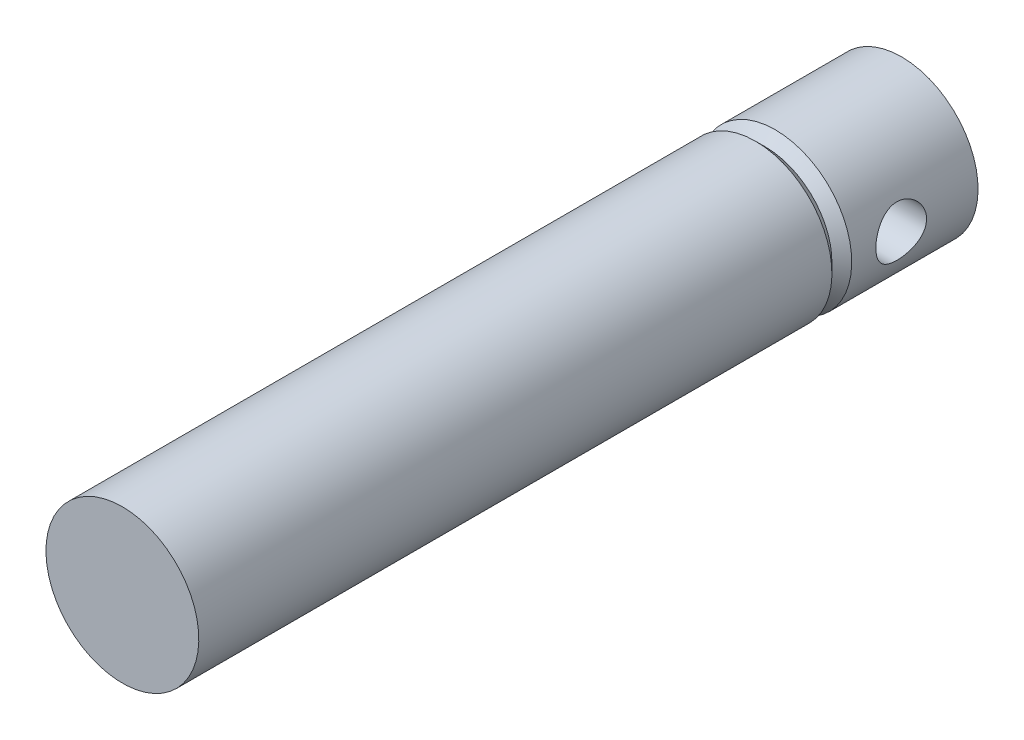
ISO-10303-21;
HEADER;
FILE_DESCRIPTION(('STEP AP214'),'2;1');
FILE_NAME('part.step','',(''),(''),'','','');
FILE_SCHEMA(('AUTOMOTIVE_DESIGN { 1 0 10303 214 1 1 1 1 }'));
ENDSEC;
DATA;
#1=APPLICATION_CONTEXT('core data for automotive mechanical design processes');
#2=APPLICATION_PROTOCOL_DEFINITION('international standard','automotive_design',2000,#1);
#3=PRODUCT_CONTEXT('',#1,'mechanical');
#4=PRODUCT('Part','Part','',(#3));
#5=PRODUCT_RELATED_PRODUCT_CATEGORY('part','',(#4));
#6=PRODUCT_DEFINITION_FORMATION('','',#4);
#7=PRODUCT_DEFINITION_CONTEXT('part definition',#1,'design');
#8=PRODUCT_DEFINITION('design','',#6,#7);
#9=PRODUCT_DEFINITION_SHAPE('','',#8);
#10=(LENGTH_UNIT() NAMED_UNIT(*) SI_UNIT(.MILLI.,.METRE.));
#11=(NAMED_UNIT(*) PLANE_ANGLE_UNIT() SI_UNIT($,.RADIAN.));
#12=(NAMED_UNIT(*) SI_UNIT($,.STERADIAN.) SOLID_ANGLE_UNIT());
#13=UNCERTAINTY_MEASURE_WITH_UNIT(LENGTH_MEASURE(1.E-05),#10,'distance_accuracy_value','');
#14=(GEOMETRIC_REPRESENTATION_CONTEXT(3) GLOBAL_UNCERTAINTY_ASSIGNED_CONTEXT((#13)) GLOBAL_UNIT_ASSIGNED_CONTEXT((#10,
#11,#12)) REPRESENTATION_CONTEXT('',''));
#15=CARTESIAN_POINT('',(0.,0.,0.));
#16=DIRECTION('',(0.,0.,1.));
#17=DIRECTION('',(1.,0.,0.));
#18=AXIS2_PLACEMENT_3D('',#15,#16,#17);
#19=CARTESIAN_POINT('',(0.,0.,-51.45));
#20=DIRECTION('',(0.,0.,-1.));
#21=DIRECTION('',(0.,1.,0.));
#22=AXIS2_PLACEMENT_3D('',#19,#20,#21);
#23=CONICAL_SURFACE('',#22,9.65000000000002,0.785398163397447);
#24=CARTESIAN_POINT('',(0.,0.,-50.2));
#25=DIRECTION('',(0.,0.,-1.));
#26=DIRECTION('',(0.,1.,0.));
#27=AXIS2_PLACEMENT_3D('',#24,#25,#26);
#28=CIRCLE('',#27,8.40000000000002);
#29=CARTESIAN_POINT('',(0.,8.40000000000001,-50.2));
#30=VERTEX_POINT('',#29);
#31=EDGE_CURVE('E52',#30,#30,#28,.T.);
#32=ORIENTED_EDGE('',*,*,#31,.T.);
#33=EDGE_LOOP('',(#32));
#34=FACE_BOUND('',#33,.T.);
#35=CARTESIAN_POINT('',(0.,0.,-51.45));
#36=DIRECTION('',(0.,0.,-1.));
#37=DIRECTION('',(0.,1.,0.));
#38=AXIS2_PLACEMENT_3D('',#35,#36,#37);
#39=CIRCLE('',#38,9.65000000000002);
#40=CARTESIAN_POINT('',(0.,9.65000000000001,-51.45));
#41=VERTEX_POINT('',#40);
#42=EDGE_CURVE('E48',#41,#41,#39,.T.);
#43=ORIENTED_EDGE('',*,*,#42,.F.);
#44=EDGE_LOOP('',(#43));
#45=FACE_BOUND('',#44,.T.);
#46=ADVANCED_FACE('F34',(#34,#45),#23,.T.);
#47=CARTESIAN_POINT('',(0.,0.,-50.2));
#48=DIRECTION('',(0.,0.,1.));
#49=DIRECTION('',(0.,-1.,0.));
#50=AXIS2_PLACEMENT_3D('',#47,#48,#49);
#51=CONICAL_SURFACE('',#50,8.40000000000002,0.785398163397447);
#52=CARTESIAN_POINT('',(0.,0.,-48.95));
#53=DIRECTION('',(0.,0.,-1.));
#54=DIRECTION('',(0.,1.,0.));
#55=AXIS2_PLACEMENT_3D('',#52,#53,#54);
#56=CIRCLE('',#55,9.65000000000002);
#57=CARTESIAN_POINT('',(0.,9.65000000000001,-48.95));
#58=VERTEX_POINT('',#57);
#59=EDGE_CURVE('E90',#58,#58,#56,.T.);
#60=ORIENTED_EDGE('',*,*,#59,.T.);
#61=EDGE_LOOP('',(#60));
#62=FACE_BOUND('',#61,.T.);
#63=ORIENTED_EDGE('',*,*,#31,.F.);
#64=EDGE_LOOP('',(#63));
#65=FACE_BOUND('',#64,.T.);
#66=ADVANCED_FACE('F70',(#62,#65),#51,.T.);
#67=CARTESIAN_POINT('',(0.,0.,-67.4));
#68=DIRECTION('',(0.,0.,-1.));
#69=DIRECTION('',(0.,1.,0.));
#70=AXIS2_PLACEMENT_3D('',#67,#68,#69);
#71=CYLINDRICAL_SURFACE('',#70,9.65);
#72=CARTESIAN_POINT('',(0.,0.,31.));
#73=DIRECTION('',(0.,0.,-1.));
#74=DIRECTION('',(0.,1.,0.));
#75=AXIS2_PLACEMENT_3D('',#72,#73,#74);
#76=CIRCLE('',#75,9.64999999999998);
#77=CARTESIAN_POINT('',(0.,9.64999999999997,31.));
#78=VERTEX_POINT('',#77);
#79=EDGE_CURVE('E87',#78,#78,#76,.T.);
#80=ORIENTED_EDGE('',*,*,#79,.T.);
#81=EDGE_LOOP('',(#80));
#82=FACE_BOUND('',#81,.T.);
#83=ORIENTED_EDGE('',*,*,#59,.F.);
#84=EDGE_LOOP('',(#83));
#85=FACE_BOUND('',#84,.T.);
#86=ADVANCED_FACE('F75',(#82,#85),#71,.T.);
#87=CARTESIAN_POINT('',(0.,9.64999999999997,31.));
#88=DIRECTION('',(0.,0.,1.));
#89=DIRECTION('',(0.,-1.,0.));
#90=AXIS2_PLACEMENT_3D('',#87,#88,#89);
#91=PLANE('',#90);
#92=ORIENTED_EDGE('',*,*,#79,.F.);
#93=EDGE_LOOP('',(#92));
#94=FACE_BOUND('',#93,.T.);
#95=ADVANCED_FACE('F98',(#94),#91,.T.);
#96=CARTESIAN_POINT('',(0.,9.64999999999998,-67.4));
#97=DIRECTION('',(0.,0.,-1.));
#98=DIRECTION('',(0.,1.,0.));
#99=AXIS2_PLACEMENT_3D('',#96,#97,#98);
#100=PLANE('',#99);
#101=CARTESIAN_POINT('',(0.,0.,-67.4));
#102=DIRECTION('',(0.,0.,-1.));
#103=DIRECTION('',(0.,1.,0.));
#104=AXIS2_PLACEMENT_3D('',#101,#102,#103);
#105=CIRCLE('',#104,9.64999999999999);
#106=CARTESIAN_POINT('',(0.,9.64999999999998,-67.4));
#107=VERTEX_POINT('',#106);
#108=EDGE_CURVE('E85',#107,#107,#105,.T.);
#109=ORIENTED_EDGE('',*,*,#108,.T.);
#110=EDGE_LOOP('',(#109));
#111=FACE_BOUND('',#110,.T.);
#112=ADVANCED_FACE('F67',(#111),#100,.T.);
#113=CARTESIAN_POINT('',(0.,0.,-67.4));
#114=DIRECTION('',(0.,0.,-1.));
#115=DIRECTION('',(0.,1.,0.));
#116=AXIS2_PLACEMENT_3D('',#113,#114,#115);
#117=CYLINDRICAL_SURFACE('',#116,9.64999999999998);
#118=CARTESIAN_POINT('',(-9.64999999999998,0.,-60.9));
#119=CARTESIAN_POINT('',(-9.65000036079675,-0.174653897789779,-60.9000006334956));
#120=CARTESIAN_POINT('',(-9.64521464054339,-0.349304342390432,-60.8856546923451));
#121=CARTESIAN_POINT('',(-9.6265946693467,-0.693464054860672,-60.8288234390391));
#122=CARTESIAN_POINT('',(-9.61275938627899,-0.862972733991802,-60.7863349171477));
#123=CARTESIAN_POINT('',(-9.57754428668876,-1.19183745681564,-60.6748328850261));
#124=CARTESIAN_POINT('',(-9.55617700830016,-1.35120985656734,-60.6058634393382));
#125=CARTESIAN_POINT('',(-9.50808103177193,-1.65612540855754,-60.443555522785));
#126=CARTESIAN_POINT('',(-9.48135129348678,-1.80166586975901,-60.350212323131));
#127=CARTESIAN_POINT('',(-9.42431958080697,-2.07978085156581,-60.1384416926786));
#128=CARTESIAN_POINT('',(-9.39393268292546,-2.21181503775299,-60.0193276481487));
#129=CARTESIAN_POINT('',(-9.33348074553266,-2.45444538078468,-59.7608565615041));
#130=CARTESIAN_POINT('',(-9.30341577725891,-2.56503688170942,-59.6214951344755));
#131=CARTESIAN_POINT('',(-9.24607931167777,-2.76471378071107,-59.3216366092404));
#132=CARTESIAN_POINT('',(-9.21891141347255,-2.85309911217317,-59.1606516163155));
#133=CARTESIAN_POINT('',(-9.171735191717,-3.00131097473524,-58.8250557433361));
#134=CARTESIAN_POINT('',(-9.15172470954563,-3.06114611817133,-58.6504489908828));
#135=CARTESIAN_POINT('',(-9.12202272136045,-3.14853630648973,-58.2987063711595));
#136=CARTESIAN_POINT('',(-9.11200881730373,-3.17710296835677,-58.1218498667209));
#137=CARTESIAN_POINT('',(-9.10247991891681,-3.20430753920392,-57.7655923829035));
#138=CARTESIAN_POINT('',(-9.10296171995759,-3.20295458346877,-57.5861921968995));
#139=CARTESIAN_POINT('',(-9.11408708981729,-3.17114427400848,-57.2385453609995));
#140=CARTESIAN_POINT('',(-9.12427072327504,-3.14200416969871,-57.0701609141696));
#141=CARTESIAN_POINT('',(-9.15290018262581,-3.05759450633912,-56.7408216981468));
#142=CARTESIAN_POINT('',(-9.1713469881602,-3.00232184909824,-56.5798678123816));
#143=CARTESIAN_POINT('',(-9.21475411841719,-2.86634805511928,-56.2669535501883));
#144=CARTESIAN_POINT('',(-9.23981382781117,-2.78525464890579,-56.1151780132885));
#145=CARTESIAN_POINT('',(-9.29358120329426,-2.60021363266278,-55.8269712961445));
#146=CARTESIAN_POINT('',(-9.32228991331454,-2.49625947623401,-55.6905445281202));
#147=CARTESIAN_POINT('',(-9.38193303527769,-2.262109756187,-55.4295022854871));
#148=CARTESIAN_POINT('',(-9.41290583034877,-2.13083640674488,-55.3058603752238));
#149=CARTESIAN_POINT('',(-9.47228964618993,-1.84903693403177,-55.0820933169678));
#150=CARTESIAN_POINT('',(-9.50070042617006,-1.69850900433555,-54.9819703779799));
#151=CARTESIAN_POINT('',(-9.55212535276175,-1.38042450575307,-54.8073103065197));
#152=CARTESIAN_POINT('',(-9.5750843054119,-1.21271651100139,-54.7330315796774));
#153=CARTESIAN_POINT('',(-9.61261823700097,-0.866242649313708,-54.6140411261345));
#154=CARTESIAN_POINT('',(-9.62719609667705,-0.687480605286535,-54.5693192394082));
#155=CARTESIAN_POINT('',(-9.64584925861248,-0.332216823692549,-54.5124310872512));
#156=CARTESIAN_POINT('',(-9.6503487502057,-0.155947763524769,-54.4989490679257));
#157=CARTESIAN_POINT('',(-9.6496089244291,0.196367595282367,-54.5011785707682));
#158=CARTESIAN_POINT('',(-9.64437123173687,0.372413926180367,-54.5168852227211));
#159=CARTESIAN_POINT('',(-9.62502543016232,0.714036631830401,-54.5760037485454));
#160=CARTESIAN_POINT('',(-9.61117539374346,0.879768452568857,-54.6186101113943));
#161=CARTESIAN_POINT('',(-9.57625871437406,1.20166671481131,-54.7293135798545));
#162=CARTESIAN_POINT('',(-9.55519115307115,1.35783193608627,-54.7974139294033));
#163=CARTESIAN_POINT('',(-9.50729522740248,1.6607156763844,-54.9591482708469));
#164=CARTESIAN_POINT('',(-9.48033061296264,1.80708033119676,-55.0534034533914));
#165=CARTESIAN_POINT('',(-9.42369998936823,2.08234469155218,-55.2640407915628));
#166=CARTESIAN_POINT('',(-9.39403316420225,2.2112390920108,-55.3804296427164));
#167=CARTESIAN_POINT('',(-9.33365266728373,2.45393135838051,-55.6382184611753));
#168=CARTESIAN_POINT('',(-9.30295186790586,2.56679043034701,-55.7805073905575));
#169=CARTESIAN_POINT('',(-9.24534070441865,2.76714270135782,-56.0826638962531));
#170=CARTESIAN_POINT('',(-9.21843036290505,2.85463574919296,-56.2425315773471));
#171=CARTESIAN_POINT('',(-9.17171356254244,3.00135317393759,-56.5753386894894));
#172=CARTESIAN_POINT('',(-9.15189147354404,3.06063984477947,-56.7482483288408));
#173=CARTESIAN_POINT('',(-9.12187321225527,3.14899171992454,-57.1024047574582));
#174=CARTESIAN_POINT('',(-9.11167276283215,3.1780703532692,-57.2836478046391));
#175=CARTESIAN_POINT('',(-9.10253569611723,3.20414022270537,-57.6394104130498));
#176=CARTESIAN_POINT('',(-9.10305263043046,3.20268807906263,-57.813803152829));
#177=CARTESIAN_POINT('',(-9.11394303786078,3.17156237273073,-58.1597220674385));
#178=CARTESIAN_POINT('',(-9.12431593583658,3.14189045679635,-58.3312484089421));
#179=CARTESIAN_POINT('',(-9.15334469410703,3.05626442270754,-58.663394433412));
#180=CARTESIAN_POINT('',(-9.1718429108824,3.00080939294464,-58.8241576346992));
#181=CARTESIAN_POINT('',(-9.2149812779449,2.86559463821178,-59.1342214908564));
#182=CARTESIAN_POINT('',(-9.23962278233338,2.78582955396444,-59.283519609094));
#183=CARTESIAN_POINT('',(-9.29360036643081,2.6002315441761,-59.5734152972728));
#184=CARTESIAN_POINT('',(-9.32309342286387,2.49342016708339,-59.7133570455521));
#185=CARTESIAN_POINT('',(-9.38278804451217,2.25842142509402,-59.9738333502889));
#186=CARTESIAN_POINT('',(-9.41298980704126,2.13022804498302,-60.0943624267388));
#187=CARTESIAN_POINT('',(-9.47209176812271,1.85018906137288,-60.3172564907992));
#188=CARTESIAN_POINT('',(-9.50089738339186,1.69762397864177,-60.4187457282145));
#189=CARTESIAN_POINT('',(-9.55267994739162,1.3766549506907,-60.5945250720055));
#190=CARTESIAN_POINT('',(-9.57565845603777,1.20825526097489,-60.6688224600005));
#191=CARTESIAN_POINT('',(-9.61225994136367,0.868727890026892,-60.7847896166535));
#192=CARTESIAN_POINT('',(-9.62627962742694,0.698120696327128,-60.8278564207411));
#193=CARTESIAN_POINT('',(-9.64514824009338,0.351673553489856,-60.8854574509999));
#194=CARTESIAN_POINT('',(-9.64999963676327,0.175835026718578,-60.8999993622203));
#195=CARTESIAN_POINT('',(-9.64999999999998,0.,-60.9));
#196=B_SPLINE_CURVE_WITH_KNOTS('',3,(#118,#119,#120,#121,#122,#123,#124,#125,#126,#127,#128,
#129,#130,#131,#132,#133,#134,#135,#136,#137,#138,#139,#140,#141,#142,#143,#144,#145,#146,#147,
#148,#149,#150,#151,#152,#153,#154,#155,#156,#157,#158,#159,#160,#161,#162,#163,#164,#165,#166,
#167,#168,#169,#170,#171,#172,#173,#174,#175,#176,#177,#178,#179,#180,#181,#182,#183,#184,#185,
#186,#187,#188,#189,#190,#191,#192,#193,#194,#195),.UNSPECIFIED.,.T.,.F.,(4,2,2,2,2,2,2,2,2,2,2,
2,2,2,2,2,2,2,2,2,2,2,2,2,2,2,2,2,2,2,2,2,2,2,2,2,2,2,4),(0.,0.52331469634723,1.04668908840194,
1.56919632802915,2.09180501549178,2.63057952218852,3.16947088405203,3.72366859541151,
4.27769902383815,4.81322069511191,5.3485788591026,5.85975776547869,6.37099729077741,
6.8904072192447,7.40996607995217,7.95635137574125,8.50278796992697,9.0545409318232,
9.60610413243313,10.1339779137768,10.6617636257472,11.1744492367464,11.6872001057149,
12.213360680681,12.7396806753238,13.2896542812725,13.8396311655962,14.388387718994,
14.936900217075,15.4575177403221,15.9781048849826,16.4890096004423,17.0000270290639,
17.5331519066392,18.0664270173798,18.6201900399881,19.1738046634571,19.7008003714976,
20.2276540791956),.UNSPECIFIED.);
#197=CARTESIAN_POINT('',(-9.64999999999998,0.,-60.9));
#198=VERTEX_POINT('',#197);
#199=EDGE_CURVE('E10',#198,#198,#196,.T.);
#200=ORIENTED_EDGE('',*,*,#199,.F.);
#201=EDGE_LOOP('',(#200));
#202=FACE_BOUND('',#201,.T.);
#203=CARTESIAN_POINT('',(9.65000000000002,0.,-60.9));
#204=CARTESIAN_POINT('',(9.65000036079678,0.174653897789769,-60.9000006334956));
#205=CARTESIAN_POINT('',(9.6452146405434,0.349304342390421,-60.8856546923451));
#206=CARTESIAN_POINT('',(9.62659466934669,0.693464054860661,-60.8288234390391));
#207=CARTESIAN_POINT('',(9.61275938627899,0.862972733991791,-60.7863349171477));
#208=CARTESIAN_POINT('',(9.57754428668877,1.19183745681563,-60.6748328850261));
#209=CARTESIAN_POINT('',(9.55617700830016,1.35120985656733,-60.6058634393382));
#210=CARTESIAN_POINT('',(9.50808103177193,1.65612540855753,-60.443555522785));
#211=CARTESIAN_POINT('',(9.48135129348678,1.801665869759,-60.350212323131));
#212=CARTESIAN_POINT('',(9.42431958080697,2.0797808515658,-60.1384416926786));
#213=CARTESIAN_POINT('',(9.39393268292546,2.21181503775298,-60.0193276481487));
#214=CARTESIAN_POINT('',(9.33348074553266,2.45444538078466,-59.7608565615041));
#215=CARTESIAN_POINT('',(9.30341577725891,2.56503688170941,-59.6214951344755));
#216=CARTESIAN_POINT('',(9.24607931167777,2.76471378071106,-59.3216366092404));
#217=CARTESIAN_POINT('',(9.21891141347256,2.85309911217316,-59.1606516163155));
#218=CARTESIAN_POINT('',(9.171735191717,3.00131097473523,-58.8250557433361));
#219=CARTESIAN_POINT('',(9.15172470954563,3.06114611817132,-58.6504489908828));
#220=CARTESIAN_POINT('',(9.12202272136045,3.14853630648972,-58.2987063711595));
#221=CARTESIAN_POINT('',(9.11200881730373,3.17710296835676,-58.1218498667209));
#222=CARTESIAN_POINT('',(9.10247991891681,3.20430753920391,-57.7655923829035));
#223=CARTESIAN_POINT('',(9.10296171995759,3.20295458346876,-57.5861921968995));
#224=CARTESIAN_POINT('',(9.11408708981729,3.17114427400847,-57.2385453609995));
#225=CARTESIAN_POINT('',(9.12427072327504,3.14200416969871,-57.0701609141696));
#226=CARTESIAN_POINT('',(9.15290018262581,3.05759450633912,-56.7408216981468));
#227=CARTESIAN_POINT('',(9.1713469881602,3.00232184909823,-56.5798678123816));
#228=CARTESIAN_POINT('',(9.21475411841719,2.86634805511927,-56.2669535501883));
#229=CARTESIAN_POINT('',(9.23981382781117,2.78525464890578,-56.1151780132885));
#230=CARTESIAN_POINT('',(9.29358120329426,2.60021363266277,-55.8269712961445));
#231=CARTESIAN_POINT('',(9.32228991331454,2.496259476234,-55.6905445281202));
#232=CARTESIAN_POINT('',(9.38193303527769,2.262109756187,-55.4295022854871));
#233=CARTESIAN_POINT('',(9.41290583034877,2.13083640674487,-55.3058603752238));
#234=CARTESIAN_POINT('',(9.47228964618993,1.84903693403176,-55.0820933169679));
#235=CARTESIAN_POINT('',(9.50070042617006,1.69850900433554,-54.9819703779799));
#236=CARTESIAN_POINT('',(9.55212535276175,1.38042450575307,-54.8073103065197));
#237=CARTESIAN_POINT('',(9.5750843054119,1.21271651100138,-54.7330315796774));
#238=CARTESIAN_POINT('',(9.61261823700097,0.866242649313699,-54.6140411261345));
#239=CARTESIAN_POINT('',(9.62719609667706,0.687480605286526,-54.5693192394082));
#240=CARTESIAN_POINT('',(9.64584925861248,0.332216823692538,-54.5124310872512));
#241=CARTESIAN_POINT('',(9.6503487502057,0.155947763524759,-54.4989490679257));
#242=CARTESIAN_POINT('',(9.6496089244291,-0.196367595282377,-54.5011785707682));
#243=CARTESIAN_POINT('',(9.64437123173687,-0.372413926180377,-54.5168852227211));
#244=CARTESIAN_POINT('',(9.62502543016232,-0.714036631830411,-54.5760037485454));
#245=CARTESIAN_POINT('',(9.61117539374346,-0.879768452568867,-54.6186101113943));
#246=CARTESIAN_POINT('',(9.57625871437405,-1.20166671481132,-54.7293135798545));
#247=CARTESIAN_POINT('',(9.55519115307115,-1.35783193608628,-54.7974139294033));
#248=CARTESIAN_POINT('',(9.50729522740248,-1.66071567638441,-54.9591482708469));
#249=CARTESIAN_POINT('',(9.48033061296264,-1.80708033119677,-55.0534034533914));
#250=CARTESIAN_POINT('',(9.42369998936823,-2.08234469155219,-55.2640407915628));
#251=CARTESIAN_POINT('',(9.39403316420225,-2.21123909201081,-55.3804296427164));
#252=CARTESIAN_POINT('',(9.33365266728373,-2.45393135838053,-55.6382184611753));
#253=CARTESIAN_POINT('',(9.30295186790586,-2.56679043034702,-55.7805073905575));
#254=CARTESIAN_POINT('',(9.24534070441865,-2.76714270135783,-56.0826638962531));
#255=CARTESIAN_POINT('',(9.21843036290505,-2.85463574919297,-56.2425315773471));
#256=CARTESIAN_POINT('',(9.17171356254244,-3.0013531739376,-56.5753386894894));
#257=CARTESIAN_POINT('',(9.15189147354404,-3.06063984477948,-56.7482483288408));
#258=CARTESIAN_POINT('',(9.12187321225527,-3.14899171992455,-57.1024047574582));
#259=CARTESIAN_POINT('',(9.11167276283215,-3.1780703532692,-57.2836478046391));
#260=CARTESIAN_POINT('',(9.10253569611723,-3.20414022270538,-57.6394104130498));
#261=CARTESIAN_POINT('',(9.10305263043046,-3.20268807906264,-57.813803152829));
#262=CARTESIAN_POINT('',(9.11394303786078,-3.17156237273074,-58.1597220674385));
#263=CARTESIAN_POINT('',(9.12431593583658,-3.14189045679636,-58.3312484089421));
#264=CARTESIAN_POINT('',(9.15334469410703,-3.05626442270755,-58.663394433412));
#265=CARTESIAN_POINT('',(9.1718429108824,-3.00080939294465,-58.8241576346992));
#266=CARTESIAN_POINT('',(9.2149812779449,-2.86559463821179,-59.1342214908564));
#267=CARTESIAN_POINT('',(9.23962278233338,-2.78582955396444,-59.283519609094));
#268=CARTESIAN_POINT('',(9.29360036643081,-2.60023154417612,-59.5734152972728));
#269=CARTESIAN_POINT('',(9.32309342286387,-2.4934201670834,-59.7133570455521));
#270=CARTESIAN_POINT('',(9.38278804451217,-2.25842142509404,-59.9738333502889));
#271=CARTESIAN_POINT('',(9.41298980704126,-2.13022804498303,-60.0943624267388));
#272=CARTESIAN_POINT('',(9.47209176812271,-1.85018906137289,-60.3172564907992));
#273=CARTESIAN_POINT('',(9.50089738339186,-1.69762397864178,-60.4187457282145));
#274=CARTESIAN_POINT('',(9.55267994739162,-1.37665495069072,-60.5945250720055));
#275=CARTESIAN_POINT('',(9.57565845603777,-1.20825526097491,-60.6688224600005));
#276=CARTESIAN_POINT('',(9.61225994136367,-0.868727890026909,-60.7847896166535));
#277=CARTESIAN_POINT('',(9.62627962742693,-0.698120696327143,-60.8278564207411));
#278=CARTESIAN_POINT('',(9.64514824009339,-0.351673553489868,-60.8854574509999));
#279=CARTESIAN_POINT('',(9.6499996367633,-0.175835026718589,-60.8999993622203));
#280=CARTESIAN_POINT('',(9.65000000000002,0.,-60.9));
#281=B_SPLINE_CURVE_WITH_KNOTS('',3,(#203,#204,#205,#206,#207,#208,#209,#210,#211,#212,#213,
#214,#215,#216,#217,#218,#219,#220,#221,#222,#223,#224,#225,#226,#227,#228,#229,#230,#231,#232,
#233,#234,#235,#236,#237,#238,#239,#240,#241,#242,#243,#244,#245,#246,#247,#248,#249,#250,#251,
#252,#253,#254,#255,#256,#257,#258,#259,#260,#261,#262,#263,#264,#265,#266,#267,#268,#269,#270,
#271,#272,#273,#274,#275,#276,#277,#278,#279,#280),.UNSPECIFIED.,.T.,.F.,(4,2,2,2,2,2,2,2,2,2,2,
2,2,2,2,2,2,2,2,2,2,2,2,2,2,2,2,2,2,2,2,2,2,2,2,2,2,2,4),(0.,0.523314696347229,1.04668908840194,
1.56919632802915,2.09180501549178,2.63057952218852,3.16947088405202,3.72366859541151,
4.27769902383815,4.81322069511191,5.34857885910259,5.85975776547869,6.37099729077741,
6.8904072192447,7.40996607995217,7.95635137574125,8.50278796992696,9.0545409318232,
9.60610413243313,10.1339779137768,10.6617636257472,11.1744492367464,11.6872001057149,
12.213360680681,12.7396806753238,13.2896542812725,13.8396311655962,14.388387718994,
14.936900217075,15.4575177403221,15.9781048849826,16.4890096004423,17.0000270290639,
17.5331519066392,18.0664270173798,18.620190039988,19.1738046634571,19.7008003714976,
20.2276540791956),.UNSPECIFIED.);
#282=CARTESIAN_POINT('',(9.65000000000002,0.,-60.9));
#283=VERTEX_POINT('',#282);
#284=EDGE_CURVE('E44',#283,#283,#281,.T.);
#285=ORIENTED_EDGE('',*,*,#284,.F.);
#286=EDGE_LOOP('',(#285));
#287=FACE_BOUND('',#286,.T.);
#288=ORIENTED_EDGE('',*,*,#42,.T.);
#289=EDGE_LOOP('',(#288));
#290=FACE_BOUND('',#289,.T.);
#291=ORIENTED_EDGE('',*,*,#108,.F.);
#292=EDGE_LOOP('',(#291));
#293=FACE_BOUND('',#292,.T.);
#294=ADVANCED_FACE('F57',(#202,#287,#290,#293),#117,.T.);
#295=CARTESIAN_POINT('',(-9.65000000000002,0.,-57.7));
#296=DIRECTION('',(1.,0.,0.));
#297=DIRECTION('',(0.,0.,-1.));
#298=AXIS2_PLACEMENT_3D('',#295,#296,#297);
#299=CYLINDRICAL_SURFACE('',#298,3.20000000000001);
#300=ORIENTED_EDGE('',*,*,#199,.T.);
#301=EDGE_LOOP('',(#300));
#302=FACE_BOUND('',#301,.T.);
#303=ORIENTED_EDGE('',*,*,#284,.T.);
#304=EDGE_LOOP('',(#303));
#305=FACE_BOUND('',#304,.T.);
#306=ADVANCED_FACE('F60',(#302,#305),#299,.F.);
#307=CLOSED_SHELL('',(#46,#66,#86,#95,#112,#294,#306));
#308=MANIFOLD_SOLID_BREP('B2',#307);
#309=ADVANCED_BREP_SHAPE_REPRESENTATION('',(#18,#308),#14);
#310=SHAPE_DEFINITION_REPRESENTATION(#9,#309);
ENDSEC;
END-ISO-10303-21;
